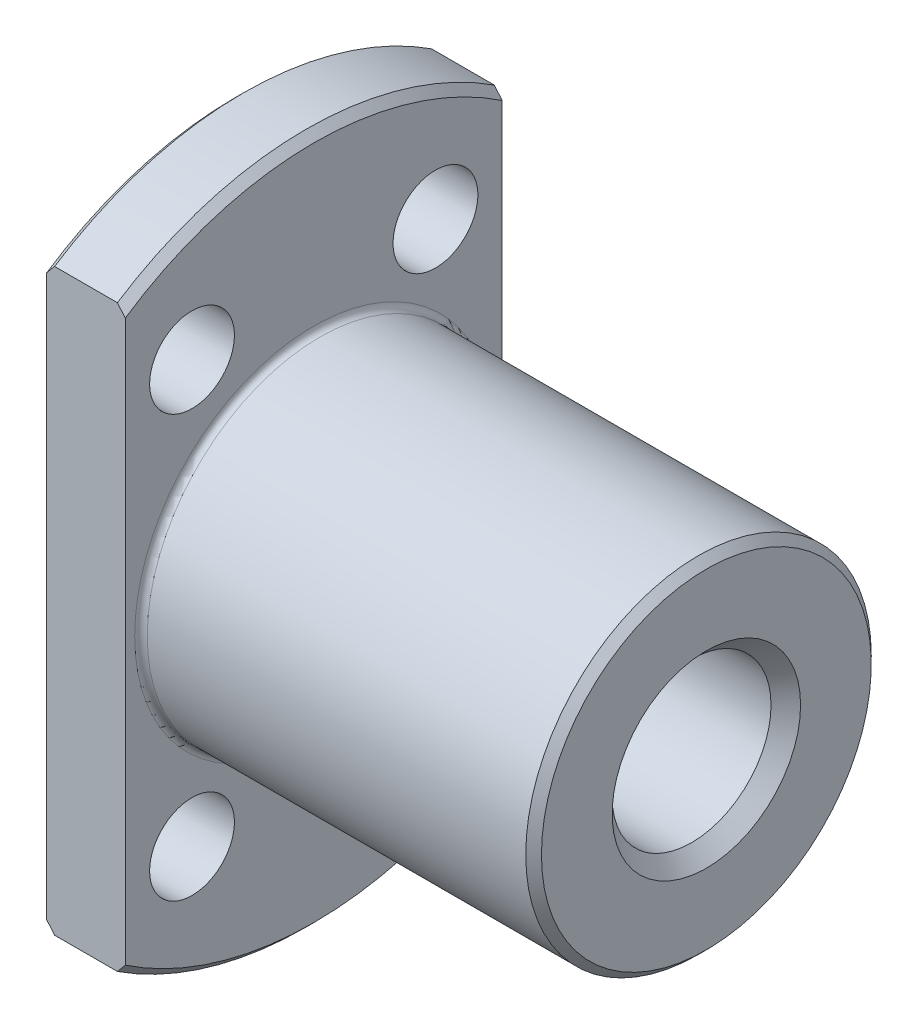
ISO-10303-21;
HEADER;
FILE_DESCRIPTION(('STEP AP214'),'2;1');
FILE_NAME('part.step','',(''),(''),'','','');
FILE_SCHEMA(('AUTOMOTIVE_DESIGN { 1 0 10303 214 1 1 1 1 }'));
ENDSEC;
DATA;
#1=APPLICATION_CONTEXT('core data for automotive mechanical design processes');
#2=APPLICATION_PROTOCOL_DEFINITION('international standard','automotive_design',2000,#1);
#3=PRODUCT_CONTEXT('',#1,'mechanical');
#4=PRODUCT('Part','Part','',(#3));
#5=PRODUCT_RELATED_PRODUCT_CATEGORY('part','',(#4));
#6=PRODUCT_DEFINITION_FORMATION('','',#4);
#7=PRODUCT_DEFINITION_CONTEXT('part definition',#1,'design');
#8=PRODUCT_DEFINITION('design','',#6,#7);
#9=PRODUCT_DEFINITION_SHAPE('','',#8);
#10=(LENGTH_UNIT() NAMED_UNIT(*) SI_UNIT(.MILLI.,.METRE.));
#11=(NAMED_UNIT(*) PLANE_ANGLE_UNIT() SI_UNIT($,.RADIAN.));
#12=(NAMED_UNIT(*) SI_UNIT($,.STERADIAN.) SOLID_ANGLE_UNIT());
#13=UNCERTAINTY_MEASURE_WITH_UNIT(LENGTH_MEASURE(1.E-05),#10,'distance_accuracy_value','');
#14=(GEOMETRIC_REPRESENTATION_CONTEXT(3) GLOBAL_UNCERTAINTY_ASSIGNED_CONTEXT((#13)) GLOBAL_UNIT_ASSIGNED_CONTEXT((#10,
#11,#12)) REPRESENTATION_CONTEXT('',''));
#15=CARTESIAN_POINT('',(0.,0.,0.));
#16=DIRECTION('',(0.,0.,1.));
#17=DIRECTION('',(1.,0.,0.));
#18=AXIS2_PLACEMENT_3D('',#15,#16,#17);
#19=CARTESIAN_POINT('',(0.499999999998697,0.,0.));
#20=DIRECTION('',(1.,0.,0.));
#21=DIRECTION('',(0.,0.,-1.));
#22=AXIS2_PLACEMENT_3D('',#19,#20,#21);
#23=CONICAL_SURFACE('',#22,22.0000000000013,0.7853981634);
#24=CARTESIAN_POINT('',(0.499999999998473,18.439088914587,-12.));
#25=CARTESIAN_POINT('',(0.416419384931429,18.3393741252756,-12.));
#26=CARTESIAN_POINT('',(0.332962411462513,18.2395562198613,-12.));
#27=CARTESIAN_POINT('',(0.166295744787639,18.03971417331,-12.));
#28=CARTESIAN_POINT('',(0.0830860515903839,17.9396900321657,-12.));
#29=CARTESIAN_POINT('',(0.,17.8395627749112,-12.));
#30=B_SPLINE_CURVE_WITH_KNOTS('',3,(#24,#25,#26,#27,#28,#29),.UNSPECIFIED.,.F.,.F.,(4,2,4),(0.,
0.39033079042897,0.780661594597441),.UNSPECIFIED.);
#31=CARTESIAN_POINT('',(0.49999999999924,18.4390889145863,-12.));
#32=VERTEX_POINT('',#31);
#33=CARTESIAN_POINT('',(0.,17.8395627749112,-12.));
#34=VERTEX_POINT('',#33);
#35=EDGE_CURVE('E101',#32,#34,#30,.T.);
#36=ORIENTED_EDGE('',*,*,#35,.T.);
#37=CARTESIAN_POINT('',(0.,0.,0.));
#38=DIRECTION('',(1.,0.,0.));
#39=DIRECTION('',(0.,0.,-1.));
#40=AXIS2_PLACEMENT_3D('',#37,#38,#39);
#41=CIRCLE('',#40,21.5);
#42=CARTESIAN_POINT('',(0.,17.8395627749112,12.));
#43=VERTEX_POINT('',#42);
#44=EDGE_CURVE('E99',#43,#34,#41,.F.);
#45=ORIENTED_EDGE('',*,*,#44,.F.);
#46=CARTESIAN_POINT('',(0.,17.8395627749112,12.));
#47=CARTESIAN_POINT('',(0.0830860515903839,17.9396900321657,12.));
#48=CARTESIAN_POINT('',(0.166295744787639,18.03971417331,12.));
#49=CARTESIAN_POINT('',(0.332962411462513,18.2395562198613,12.));
#50=CARTESIAN_POINT('',(0.416419384931428,18.3393741252756,12.));
#51=CARTESIAN_POINT('',(0.499999999998474,18.439088914587,12.));
#52=B_SPLINE_CURVE_WITH_KNOTS('',3,(#46,#47,#48,#49,#50,#51),.UNSPECIFIED.,.F.,.F.,(4,2,4),(0.,
0.390330804168474,0.780661594597444),.UNSPECIFIED.);
#53=CARTESIAN_POINT('',(0.49999999999924,18.4390889145863,12.));
#54=VERTEX_POINT('',#53);
#55=EDGE_CURVE('E21',#43,#54,#52,.T.);
#56=ORIENTED_EDGE('',*,*,#55,.T.);
#57=CARTESIAN_POINT('',(0.500000000000007,0.,0.));
#58=DIRECTION('',(1.,0.,0.));
#59=DIRECTION('',(0.,0.,-1.));
#60=AXIS2_PLACEMENT_3D('',#57,#58,#59);
#61=CIRCLE('',#60,22.);
#62=EDGE_CURVE('E96',#32,#54,#61,.T.);
#63=ORIENTED_EDGE('',*,*,#62,.F.);
#64=EDGE_LOOP('',(#36,#45,#56,#63));
#65=FACE_BOUND('',#64,.T.);
#66=ADVANCED_FACE('F17',(#65),#23,.T.);
#67=CARTESIAN_POINT('',(0.499999999998697,0.,0.));
#68=DIRECTION('',(1.,0.,0.));
#69=DIRECTION('',(0.,0.,-1.));
#70=AXIS2_PLACEMENT_3D('',#67,#68,#69);
#71=CONICAL_SURFACE('',#70,22.0000000000013,0.7853981634);
#72=CARTESIAN_POINT('',(0.499999999998472,-18.439088914587,12.));
#73=CARTESIAN_POINT('',(0.416419384931427,-18.3393741252756,12.));
#74=CARTESIAN_POINT('',(0.332962411462512,-18.2395562198613,12.));
#75=CARTESIAN_POINT('',(0.166295744787637,-18.03971417331,12.));
#76=CARTESIAN_POINT('',(0.083086051590382,-17.9396900321657,12.));
#77=CARTESIAN_POINT('',(0.,-17.8395627749112,12.));
#78=B_SPLINE_CURVE_WITH_KNOTS('',3,(#72,#73,#74,#75,#76,#77),.UNSPECIFIED.,.F.,.F.,(4,2,4),(0.,
0.39033079042897,0.780661594597445),.UNSPECIFIED.);
#79=CARTESIAN_POINT('',(0.49999999999924,-18.4390889145863,12.));
#80=VERTEX_POINT('',#79);
#81=CARTESIAN_POINT('',(0.,-17.8395627749112,12.));
#82=VERTEX_POINT('',#81);
#83=EDGE_CURVE('E132',#80,#82,#78,.T.);
#84=ORIENTED_EDGE('',*,*,#83,.T.);
#85=CARTESIAN_POINT('',(0.,0.,0.));
#86=DIRECTION('',(1.,0.,0.));
#87=DIRECTION('',(0.,0.,-1.));
#88=AXIS2_PLACEMENT_3D('',#85,#86,#87);
#89=CIRCLE('',#88,21.5);
#90=CARTESIAN_POINT('',(0.,-17.8395627749112,-12.));
#91=VERTEX_POINT('',#90);
#92=EDGE_CURVE('E217',#91,#82,#89,.F.);
#93=ORIENTED_EDGE('',*,*,#92,.F.);
#94=CARTESIAN_POINT('',(0.,-17.8395627749112,-12.));
#95=CARTESIAN_POINT('',(0.0830860515903842,-17.9396900321657,-12.));
#96=CARTESIAN_POINT('',(0.166295744787639,-18.03971417331,-12.));
#97=CARTESIAN_POINT('',(0.332962411462515,-18.2395562198613,-12.));
#98=CARTESIAN_POINT('',(0.416419384931431,-18.3393741252756,-12.));
#99=CARTESIAN_POINT('',(0.499999999998477,-18.439088914587,-12.));
#100=B_SPLINE_CURVE_WITH_KNOTS('',3,(#94,#95,#96,#97,#98,#99),.UNSPECIFIED.,.F.,.F.,(4,2,4),(0.,
0.390330804168474,0.780661594597449),.UNSPECIFIED.);
#101=CARTESIAN_POINT('',(0.499999999999242,-18.4390889145864,-12.));
#102=VERTEX_POINT('',#101);
#103=EDGE_CURVE('E226',#91,#102,#100,.T.);
#104=ORIENTED_EDGE('',*,*,#103,.T.);
#105=CARTESIAN_POINT('',(0.500000000000007,0.,0.));
#106=DIRECTION('',(1.,0.,0.));
#107=DIRECTION('',(0.,0.,-1.));
#108=AXIS2_PLACEMENT_3D('',#105,#106,#107);
#109=CIRCLE('',#108,22.);
#110=EDGE_CURVE('E109',#80,#102,#109,.T.);
#111=ORIENTED_EDGE('',*,*,#110,.F.);
#112=EDGE_LOOP('',(#84,#93,#104,#111));
#113=FACE_BOUND('',#112,.T.);
#114=ADVANCED_FACE('F231',(#113),#71,.T.);
#115=CARTESIAN_POINT('',(5.6843418860808E-11,0.,0.));
#116=DIRECTION('',(-1.,0.,0.));
#117=DIRECTION('',(0.,0.,1.));
#118=AXIS2_PLACEMENT_3D('',#115,#116,#117);
#119=CONICAL_SURFACE('',#118,5.99999999997181,0.785398163367245);
#120=CARTESIAN_POINT('',(5.6843418860808E-11,0.,0.));
#121=DIRECTION('',(-1.,0.,0.));
#122=DIRECTION('',(0.,0.,1.));
#123=AXIS2_PLACEMENT_3D('',#120,#121,#122);
#124=CIRCLE('',#123,5.99999999997181);
#125=CARTESIAN_POINT('',(5.6843418860808E-11,0.,5.99999999997181));
#126=VERTEX_POINT('',#125);
#127=EDGE_CURVE('E213',#126,#126,#124,.F.);
#128=ORIENTED_EDGE('',*,*,#127,.F.);
#129=EDGE_LOOP('',(#128));
#130=FACE_BOUND('',#129,.T.);
#131=CARTESIAN_POINT('',(0.940999999995196,0.,0.));
#132=DIRECTION('',(-1.,0.,0.));
#133=DIRECTION('',(0.,0.,1.));
#134=AXIS2_PLACEMENT_3D('',#131,#132,#133);
#135=CIRCLE('',#134,5.059);
#136=CARTESIAN_POINT('',(0.940999999995196,0.,5.059));
#137=VERTEX_POINT('',#136);
#138=EDGE_CURVE('E216',#137,#137,#135,.F.);
#139=ORIENTED_EDGE('',*,*,#138,.T.);
#140=EDGE_LOOP('',(#139));
#141=FACE_BOUND('',#140,.T.);
#142=ADVANCED_FACE('F235',(#130,#141),#119,.F.);
#143=CARTESIAN_POINT('',(5.,0.,0.));
#144=DIRECTION('',(1.,0.,0.));
#145=DIRECTION('',(0.,0.,-1.));
#146=AXIS2_PLACEMENT_3D('',#143,#144,#145);
#147=CYLINDRICAL_SURFACE('',#146,22.);
#148=DIRECTION('',(1.,0.,0.));
#149=VECTOR('',#148,1.);
#150=CARTESIAN_POINT('',(5.,-18.4390889145857,12.));
#151=LINE('',#150,#149);
#152=CARTESIAN_POINT('',(4.50000000000003,-18.4390889145857,12.));
#153=VERTEX_POINT('',#152);
#154=EDGE_CURVE('E126',#80,#153,#151,.T.);
#155=ORIENTED_EDGE('',*,*,#154,.F.);
#156=ORIENTED_EDGE('',*,*,#110,.T.);
#157=DIRECTION('',(-1.,0.,0.));
#158=VECTOR('',#157,1.);
#159=CARTESIAN_POINT('',(5.,-18.4390889145857,-12.));
#160=LINE('',#159,#158);
#161=CARTESIAN_POINT('',(4.50000000000005,-18.4390889145857,-12.));
#162=VERTEX_POINT('',#161);
#163=EDGE_CURVE('E133',#162,#102,#160,.T.);
#164=ORIENTED_EDGE('',*,*,#163,.F.);
#165=CARTESIAN_POINT('',(4.50000000000003,0.,0.));
#166=DIRECTION('',(-1.,0.,0.));
#167=DIRECTION('',(0.,0.,1.));
#168=AXIS2_PLACEMENT_3D('',#165,#166,#167);
#169=CIRCLE('',#168,22.);
#170=EDGE_CURVE('E123',#153,#162,#169,.F.);
#171=ORIENTED_EDGE('',*,*,#170,.F.);
#172=EDGE_LOOP('',(#155,#156,#164,#171));
#173=FACE_BOUND('',#172,.T.);
#174=ADVANCED_FACE('F240',(#173),#147,.T.);
#175=CARTESIAN_POINT('',(5.,0.,0.));
#176=DIRECTION('',(1.,0.,0.));
#177=DIRECTION('',(0.,0.,-1.));
#178=AXIS2_PLACEMENT_3D('',#175,#176,#177);
#179=CYLINDRICAL_SURFACE('',#178,22.);
#180=DIRECTION('',(-1.,0.,0.));
#181=VECTOR('',#180,1.);
#182=CARTESIAN_POINT('',(5.,18.4390889145857,-12.));
#183=LINE('',#182,#181);
#184=CARTESIAN_POINT('',(4.50000000000003,18.4390889145857,-12.));
#185=VERTEX_POINT('',#184);
#186=EDGE_CURVE('E108',#32,#185,#183,.F.);
#187=ORIENTED_EDGE('',*,*,#186,.F.);
#188=ORIENTED_EDGE('',*,*,#62,.T.);
#189=DIRECTION('',(1.,0.,0.));
#190=VECTOR('',#189,1.);
#191=CARTESIAN_POINT('',(5.,18.4390889145857,12.));
#192=LINE('',#191,#190);
#193=CARTESIAN_POINT('',(4.50000000000005,18.4390889145857,12.));
#194=VERTEX_POINT('',#193);
#195=EDGE_CURVE('E105',#194,#54,#192,.F.);
#196=ORIENTED_EDGE('',*,*,#195,.F.);
#197=CARTESIAN_POINT('',(4.50000000000003,0.,0.));
#198=DIRECTION('',(-1.,0.,0.));
#199=DIRECTION('',(0.,0.,1.));
#200=AXIS2_PLACEMENT_3D('',#197,#198,#199);
#201=CIRCLE('',#200,22.);
#202=EDGE_CURVE('E122',#185,#194,#201,.F.);
#203=ORIENTED_EDGE('',*,*,#202,.F.);
#204=EDGE_LOOP('',(#187,#188,#196,#203));
#205=FACE_BOUND('',#204,.T.);
#206=ADVANCED_FACE('F104',(#205),#179,.T.);
#207=CARTESIAN_POINT('',(0.,0.,0.));
#208=DIRECTION('',(-1.,0.,0.));
#209=DIRECTION('',(0.,0.,1.));
#210=AXIS2_PLACEMENT_3D('',#207,#208,#209);
#211=PLANE('',#210);
#212=CARTESIAN_POINT('',(0.,13.4233937586588,7.75));
#213=DIRECTION('',(-1.,0.,0.));
#214=DIRECTION('',(0.,0.,1.));
#215=AXIS2_PLACEMENT_3D('',#212,#213,#214);
#216=CIRCLE('',#215,2.7);
#217=CARTESIAN_POINT('',(0.,13.4233937586588,10.45));
#218=VERTEX_POINT('',#217);
#219=EDGE_CURVE('E167',#218,#218,#216,.F.);
#220=ORIENTED_EDGE('',*,*,#219,.T.);
#221=EDGE_LOOP('',(#220));
#222=FACE_BOUND('',#221,.T.);
#223=CARTESIAN_POINT('',(0.,13.4233937586588,-7.75));
#224=DIRECTION('',(-1.,0.,0.));
#225=DIRECTION('',(0.,0.,1.));
#226=AXIS2_PLACEMENT_3D('',#223,#224,#225);
#227=CIRCLE('',#226,2.7);
#228=CARTESIAN_POINT('',(0.,13.4233937586588,-5.05));
#229=VERTEX_POINT('',#228);
#230=EDGE_CURVE('E170',#229,#229,#227,.F.);
#231=ORIENTED_EDGE('',*,*,#230,.T.);
#232=EDGE_LOOP('',(#231));
#233=FACE_BOUND('',#232,.T.);
#234=CARTESIAN_POINT('',(0.,-13.4233937586588,-7.75));
#235=DIRECTION('',(-1.,0.,0.));
#236=DIRECTION('',(0.,0.,1.));
#237=AXIS2_PLACEMENT_3D('',#234,#235,#236);
#238=CIRCLE('',#237,2.7);
#239=CARTESIAN_POINT('',(0.,-13.4233937586588,-5.05));
#240=VERTEX_POINT('',#239);
#241=EDGE_CURVE('E173',#240,#240,#238,.F.);
#242=ORIENTED_EDGE('',*,*,#241,.T.);
#243=EDGE_LOOP('',(#242));
#244=FACE_BOUND('',#243,.T.);
#245=CARTESIAN_POINT('',(0.,-13.4233937586588,7.75));
#246=DIRECTION('',(-1.,0.,0.));
#247=DIRECTION('',(0.,0.,1.));
#248=AXIS2_PLACEMENT_3D('',#245,#246,#247);
#249=CIRCLE('',#248,2.7);
#250=CARTESIAN_POINT('',(0.,-13.4233937586588,10.45));
#251=VERTEX_POINT('',#250);
#252=EDGE_CURVE('E116',#251,#251,#249,.F.);
#253=ORIENTED_EDGE('',*,*,#252,.T.);
#254=EDGE_LOOP('',(#253));
#255=FACE_BOUND('',#254,.T.);
#256=ORIENTED_EDGE('',*,*,#127,.T.);
#257=EDGE_LOOP('',(#256));
#258=FACE_BOUND('',#257,.T.);
#259=DIRECTION('',(0.,1.,0.));
#260=VECTOR('',#259,1.);
#261=CARTESIAN_POINT('',(0.,18.4390889145857,-12.));
#262=LINE('',#261,#260);
#263=EDGE_CURVE('E136',#91,#34,#262,.T.);
#264=ORIENTED_EDGE('',*,*,#263,.F.);
#265=ORIENTED_EDGE('',*,*,#92,.T.);
#266=DIRECTION('',(0.,1.,0.));
#267=VECTOR('',#266,1.);
#268=CARTESIAN_POINT('',(0.,-18.4390889145857,12.));
#269=LINE('',#268,#267);
#270=EDGE_CURVE('E114',#43,#82,#269,.F.);
#271=ORIENTED_EDGE('',*,*,#270,.F.);
#272=ORIENTED_EDGE('',*,*,#44,.T.);
#273=EDGE_LOOP('',(#264,#265,#271,#272));
#274=FACE_BOUND('',#273,.T.);
#275=ADVANCED_FACE('F246',(#222,#233,#244,#255,#258,#274),#211,.T.);
#276=CARTESIAN_POINT('',(30.,0.,0.));
#277=DIRECTION('',(-1.,0.,0.));
#278=DIRECTION('',(0.,0.,1.));
#279=AXIS2_PLACEMENT_3D('',#276,#277,#278);
#280=CYLINDRICAL_SURFACE('',#279,5.059);
#281=ORIENTED_EDGE('',*,*,#138,.F.);
#282=EDGE_LOOP('',(#281));
#283=FACE_BOUND('',#282,.T.);
#284=CARTESIAN_POINT('',(29.0590000000179,0.,0.));
#285=DIRECTION('',(1.,0.,0.));
#286=DIRECTION('',(0.,0.,-1.));
#287=AXIS2_PLACEMENT_3D('',#284,#285,#286);
#288=CIRCLE('',#287,5.05899999996018);
#289=CARTESIAN_POINT('',(29.0590000000179,0.,-5.05899999996018));
#290=VERTEX_POINT('',#289);
#291=EDGE_CURVE('E166',#290,#290,#288,.T.);
#292=ORIENTED_EDGE('',*,*,#291,.T.);
#293=EDGE_LOOP('',(#292));
#294=FACE_BOUND('',#293,.T.);
#295=ADVANCED_FACE('F197',(#283,#294),#280,.F.);
#296=CARTESIAN_POINT('',(4.50000000000003,0.,0.));
#297=DIRECTION('',(-1.,0.,0.));
#298=DIRECTION('',(0.,0.,1.));
#299=AXIS2_PLACEMENT_3D('',#296,#297,#298);
#300=CONICAL_SURFACE('',#299,22.,0.785398163399998);
#301=CARTESIAN_POINT('',(4.50000000000004,18.4390889145857,-12.));
#302=CARTESIAN_POINT('',(4.58358061506707,18.3393741252743,-12.));
#303=CARTESIAN_POINT('',(4.66703758853597,18.2395562198601,-12.));
#304=CARTESIAN_POINT('',(4.83370425521082,18.0397141733088,-12.));
#305=CARTESIAN_POINT('',(4.91691394840807,17.9396900321645,-12.));
#306=CARTESIAN_POINT('',(4.99999999999847,17.83956277491,-12.));
#307=B_SPLINE_CURVE_WITH_KNOTS('',3,(#301,#302,#303,#304,#305,#306),.UNSPECIFIED.,.F.,.F.,(4,2,
4),(0.,0.390330790428918,0.780661594597336),.UNSPECIFIED.);
#308=CARTESIAN_POINT('',(4.99999999999859,17.8395627749099,-12.));
#309=VERTEX_POINT('',#308);
#310=EDGE_CURVE('E137',#185,#309,#307,.T.);
#311=ORIENTED_EDGE('',*,*,#310,.F.);
#312=ORIENTED_EDGE('',*,*,#202,.T.);
#313=CARTESIAN_POINT('',(4.99999999999847,17.83956277491,12.));
#314=CARTESIAN_POINT('',(4.91691394840807,17.9396900321645,12.));
#315=CARTESIAN_POINT('',(4.83370425521082,18.0397141733088,12.));
#316=CARTESIAN_POINT('',(4.66703758853597,18.2395562198601,12.));
#317=CARTESIAN_POINT('',(4.58358061506707,18.3393741252743,12.));
#318=CARTESIAN_POINT('',(4.50000000000004,18.4390889145857,12.));
#319=B_SPLINE_CURVE_WITH_KNOTS('',3,(#313,#314,#315,#316,#317,#318),.UNSPECIFIED.,.F.,.F.,(4,2,
4),(0.,0.390330804168418,0.780661594597337),.UNSPECIFIED.);
#320=CARTESIAN_POINT('',(4.99999999999859,17.8395627749099,12.));
#321=VERTEX_POINT('',#320);
#322=EDGE_CURVE('E113',#321,#194,#319,.T.);
#323=ORIENTED_EDGE('',*,*,#322,.F.);
#324=CARTESIAN_POINT('',(4.99999999999871,0.,0.));
#325=DIRECTION('',(-1.,0.,0.));
#326=DIRECTION('',(0.,0.,1.));
#327=AXIS2_PLACEMENT_3D('',#324,#325,#326);
#328=CIRCLE('',#327,21.4999999999987);
#329=EDGE_CURVE('E164',#321,#309,#328,.T.);
#330=ORIENTED_EDGE('',*,*,#329,.T.);
#331=EDGE_LOOP('',(#311,#312,#323,#330));
#332=FACE_BOUND('',#331,.T.);
#333=ADVANCED_FACE('F191',(#332),#300,.T.);
#334=CARTESIAN_POINT('',(5.,18.4390889145857,-12.));
#335=DIRECTION('',(0.,0.,-1.));
#336=DIRECTION('',(-1.,0.,0.));
#337=AXIS2_PLACEMENT_3D('',#334,#335,#336);
#338=PLANE('',#337);
#339=ORIENTED_EDGE('',*,*,#186,.T.);
#340=ORIENTED_EDGE('',*,*,#310,.T.);
#341=DIRECTION('',(0.,1.,0.));
#342=VECTOR('',#341,1.);
#343=CARTESIAN_POINT('',(5.,0.,-12.));
#344=LINE('',#343,#342);
#345=CARTESIAN_POINT('',(4.99999999999924,-17.8395627749091,-12.));
#346=VERTEX_POINT('',#345);
#347=EDGE_CURVE('E163',#309,#346,#344,.F.);
#348=ORIENTED_EDGE('',*,*,#347,.T.);
#349=CARTESIAN_POINT('',(4.50000000000003,-18.4390889145857,-12.));
#350=CARTESIAN_POINT('',(4.58358061506707,-18.3393741252743,-12.));
#351=CARTESIAN_POINT('',(4.66703758853597,-18.2395562198601,-12.));
#352=CARTESIAN_POINT('',(4.83370425521082,-18.0397141733088,-12.));
#353=CARTESIAN_POINT('',(4.91691394840807,-17.9396900321645,-12.));
#354=CARTESIAN_POINT('',(4.99999999999847,-17.83956277491,-12.));
#355=B_SPLINE_CURVE_WITH_KNOTS('',3,(#349,#350,#351,#352,#353,#354),.UNSPECIFIED.,.F.,.F.,(4,2,
4),(0.,0.390330790428921,0.780661594597343),.UNSPECIFIED.);
#356=EDGE_CURVE('E127',#162,#346,#355,.T.);
#357=ORIENTED_EDGE('',*,*,#356,.F.);
#358=ORIENTED_EDGE('',*,*,#163,.T.);
#359=ORIENTED_EDGE('',*,*,#103,.F.);
#360=ORIENTED_EDGE('',*,*,#263,.T.);
#361=ORIENTED_EDGE('',*,*,#35,.F.);
#362=EDGE_LOOP('',(#339,#340,#348,#357,#358,#359,#360,#361));
#363=FACE_BOUND('',#362,.T.);
#364=ADVANCED_FACE('F196',(#363),#338,.T.);
#365=CARTESIAN_POINT('',(4.50000000000003,0.,0.));
#366=DIRECTION('',(-1.,0.,0.));
#367=DIRECTION('',(0.,0.,1.));
#368=AXIS2_PLACEMENT_3D('',#365,#366,#367);
#369=CONICAL_SURFACE('',#368,22.,0.785398163399998);
#370=CARTESIAN_POINT('',(4.50000000000003,-18.4390889145857,12.));
#371=CARTESIAN_POINT('',(4.58358061506707,-18.3393741252743,12.));
#372=CARTESIAN_POINT('',(4.66703758853597,-18.2395562198601,12.));
#373=CARTESIAN_POINT('',(4.83370425521082,-18.0397141733088,12.));
#374=CARTESIAN_POINT('',(4.91691394840807,-17.9396900321645,12.));
#375=CARTESIAN_POINT('',(4.99999999999847,-17.83956277491,12.));
#376=B_SPLINE_CURVE_WITH_KNOTS('',3,(#370,#371,#372,#373,#374,#375),.UNSPECIFIED.,.F.,.F.,(4,2,
4),(0.,0.390330790428919,0.780661594597338),.UNSPECIFIED.);
#377=CARTESIAN_POINT('',(4.99999999999859,-17.8395627749099,12.));
#378=VERTEX_POINT('',#377);
#379=EDGE_CURVE('E118',#153,#378,#376,.T.);
#380=ORIENTED_EDGE('',*,*,#379,.F.);
#381=ORIENTED_EDGE('',*,*,#170,.T.);
#382=ORIENTED_EDGE('',*,*,#356,.T.);
#383=CARTESIAN_POINT('',(4.99999999999871,0.,0.));
#384=DIRECTION('',(-1.,0.,0.));
#385=DIRECTION('',(0.,0.,1.));
#386=AXIS2_PLACEMENT_3D('',#383,#384,#385);
#387=CIRCLE('',#386,21.4999999999987);
#388=EDGE_CURVE('E161',#346,#378,#387,.T.);
#389=ORIENTED_EDGE('',*,*,#388,.T.);
#390=EDGE_LOOP('',(#380,#381,#382,#389));
#391=FACE_BOUND('',#390,.T.);
#392=ADVANCED_FACE('F424',(#391),#369,.T.);
#393=CARTESIAN_POINT('',(5.,-18.4390889145857,12.));
#394=DIRECTION('',(0.,0.,1.));
#395=DIRECTION('',(1.,0.,0.));
#396=AXIS2_PLACEMENT_3D('',#393,#394,#395);
#397=PLANE('',#396);
#398=ORIENTED_EDGE('',*,*,#270,.T.);
#399=ORIENTED_EDGE('',*,*,#83,.F.);
#400=ORIENTED_EDGE('',*,*,#154,.T.);
#401=ORIENTED_EDGE('',*,*,#379,.T.);
#402=DIRECTION('',(0.,1.,0.));
#403=VECTOR('',#402,1.);
#404=CARTESIAN_POINT('',(5.,0.,12.));
#405=LINE('',#404,#403);
#406=EDGE_CURVE('E160',#378,#321,#405,.T.);
#407=ORIENTED_EDGE('',*,*,#406,.T.);
#408=ORIENTED_EDGE('',*,*,#322,.T.);
#409=ORIENTED_EDGE('',*,*,#195,.T.);
#410=ORIENTED_EDGE('',*,*,#55,.F.);
#411=EDGE_LOOP('',(#398,#399,#400,#401,#407,#408,#409,#410));
#412=FACE_BOUND('',#411,.T.);
#413=ADVANCED_FACE('F111',(#412),#397,.T.);
#414=CARTESIAN_POINT('',(5.,-13.4233937586588,7.75));
#415=DIRECTION('',(-1.,0.,0.));
#416=DIRECTION('',(0.,0.,1.));
#417=AXIS2_PLACEMENT_3D('',#414,#415,#416);
#418=CYLINDRICAL_SURFACE('',#417,2.7);
#419=ORIENTED_EDGE('',*,*,#252,.F.);
#420=EDGE_LOOP('',(#419));
#421=FACE_BOUND('',#420,.T.);
#422=CARTESIAN_POINT('',(5.,-13.4233937586588,7.75));
#423=DIRECTION('',(-1.,0.,0.));
#424=DIRECTION('',(0.,0.,1.));
#425=AXIS2_PLACEMENT_3D('',#422,#423,#424);
#426=CIRCLE('',#425,2.7);
#427=CARTESIAN_POINT('',(5.,-13.4233937586588,10.45));
#428=VERTEX_POINT('',#427);
#429=EDGE_CURVE('E157',#428,#428,#426,.F.);
#430=ORIENTED_EDGE('',*,*,#429,.T.);
#431=EDGE_LOOP('',(#430));
#432=FACE_BOUND('',#431,.T.);
#433=ADVANCED_FACE('F408',(#421,#432),#418,.F.);
#434=CARTESIAN_POINT('',(5.,-13.4233937586588,-7.75));
#435=DIRECTION('',(-1.,0.,0.));
#436=DIRECTION('',(0.,0.,1.));
#437=AXIS2_PLACEMENT_3D('',#434,#435,#436);
#438=CYLINDRICAL_SURFACE('',#437,2.7);
#439=ORIENTED_EDGE('',*,*,#241,.F.);
#440=EDGE_LOOP('',(#439));
#441=FACE_BOUND('',#440,.T.);
#442=CARTESIAN_POINT('',(5.,-13.4233937586588,-7.75));
#443=DIRECTION('',(-1.,0.,0.));
#444=DIRECTION('',(0.,0.,1.));
#445=AXIS2_PLACEMENT_3D('',#442,#443,#444);
#446=CIRCLE('',#445,2.7);
#447=CARTESIAN_POINT('',(5.,-13.4233937586588,-5.05));
#448=VERTEX_POINT('',#447);
#449=EDGE_CURVE('E154',#448,#448,#446,.F.);
#450=ORIENTED_EDGE('',*,*,#449,.T.);
#451=EDGE_LOOP('',(#450));
#452=FACE_BOUND('',#451,.T.);
#453=ADVANCED_FACE('F399',(#441,#452),#438,.F.);
#454=CARTESIAN_POINT('',(5.,13.4233937586588,-7.75));
#455=DIRECTION('',(-1.,0.,0.));
#456=DIRECTION('',(0.,0.,1.));
#457=AXIS2_PLACEMENT_3D('',#454,#455,#456);
#458=CYLINDRICAL_SURFACE('',#457,2.7);
#459=ORIENTED_EDGE('',*,*,#230,.F.);
#460=EDGE_LOOP('',(#459));
#461=FACE_BOUND('',#460,.T.);
#462=CARTESIAN_POINT('',(5.,13.4233937586588,-7.75));
#463=DIRECTION('',(-1.,0.,0.));
#464=DIRECTION('',(0.,0.,1.));
#465=AXIS2_PLACEMENT_3D('',#462,#463,#464);
#466=CIRCLE('',#465,2.7);
#467=CARTESIAN_POINT('',(5.,13.4233937586588,-5.05));
#468=VERTEX_POINT('',#467);
#469=EDGE_CURVE('E151',#468,#468,#466,.F.);
#470=ORIENTED_EDGE('',*,*,#469,.T.);
#471=EDGE_LOOP('',(#470));
#472=FACE_BOUND('',#471,.T.);
#473=ADVANCED_FACE('F340',(#461,#472),#458,.F.);
#474=CARTESIAN_POINT('',(5.,13.4233937586588,7.75));
#475=DIRECTION('',(-1.,0.,0.));
#476=DIRECTION('',(0.,0.,1.));
#477=AXIS2_PLACEMENT_3D('',#474,#475,#476);
#478=CYLINDRICAL_SURFACE('',#477,2.7);
#479=ORIENTED_EDGE('',*,*,#219,.F.);
#480=EDGE_LOOP('',(#479));
#481=FACE_BOUND('',#480,.T.);
#482=CARTESIAN_POINT('',(5.,13.4233937586588,7.75));
#483=DIRECTION('',(-1.,0.,0.));
#484=DIRECTION('',(0.,0.,1.));
#485=AXIS2_PLACEMENT_3D('',#482,#483,#484);
#486=CIRCLE('',#485,2.7);
#487=CARTESIAN_POINT('',(5.,13.4233937586588,10.45));
#488=VERTEX_POINT('',#487);
#489=EDGE_CURVE('E148',#488,#488,#486,.F.);
#490=ORIENTED_EDGE('',*,*,#489,.T.);
#491=EDGE_LOOP('',(#490));
#492=FACE_BOUND('',#491,.T.);
#493=ADVANCED_FACE('F335',(#481,#492),#478,.F.);
#494=CARTESIAN_POINT('',(29.9999999999727,0.,0.));
#495=DIRECTION('',(1.,0.,0.));
#496=DIRECTION('',(0.,0.,-1.));
#497=AXIS2_PLACEMENT_3D('',#494,#495,#496);
#498=CONICAL_SURFACE('',#497,5.99999999991496,0.785398163397448);
#499=CARTESIAN_POINT('',(30.0000000000296,0.,0.));
#500=DIRECTION('',(1.,0.,0.));
#501=DIRECTION('',(0.,0.,-1.));
#502=AXIS2_PLACEMENT_3D('',#499,#500,#501);
#503=CIRCLE('',#502,5.99999999997181);
#504=CARTESIAN_POINT('',(30.0000000000296,0.,-5.99999999997181));
#505=VERTEX_POINT('',#504);
#506=EDGE_CURVE('E145',#505,#505,#503,.F.);
#507=ORIENTED_EDGE('',*,*,#506,.F.);
#508=EDGE_LOOP('',(#507));
#509=FACE_BOUND('',#508,.T.);
#510=ORIENTED_EDGE('',*,*,#291,.F.);
#511=EDGE_LOOP('',(#510));
#512=FACE_BOUND('',#511,.T.);
#513=ADVANCED_FACE('F294',(#509,#512),#498,.F.);
#514=CARTESIAN_POINT('',(5.,0.,0.));
#515=DIRECTION('',(-1.,0.,0.));
#516=DIRECTION('',(0.,0.,1.));
#517=AXIS2_PLACEMENT_3D('',#514,#515,#516);
#518=PLANE('',#517);
#519=ORIENTED_EDGE('',*,*,#489,.F.);
#520=EDGE_LOOP('',(#519));
#521=FACE_BOUND('',#520,.T.);
#522=ORIENTED_EDGE('',*,*,#469,.F.);
#523=EDGE_LOOP('',(#522));
#524=FACE_BOUND('',#523,.T.);
#525=ORIENTED_EDGE('',*,*,#449,.F.);
#526=EDGE_LOOP('',(#525));
#527=FACE_BOUND('',#526,.T.);
#528=ORIENTED_EDGE('',*,*,#429,.F.);
#529=EDGE_LOOP('',(#528));
#530=FACE_BOUND('',#529,.T.);
#531=CARTESIAN_POINT('',(5.,0.,0.));
#532=DIRECTION('',(1.,0.,0.));
#533=DIRECTION('',(0.,0.,1.));
#534=AXIS2_PLACEMENT_3D('',#531,#532,#533);
#535=CIRCLE('',#534,11.4);
#536=CARTESIAN_POINT('',(5.,0.,-11.4));
#537=VERTEX_POINT('',#536);
#538=CARTESIAN_POINT('',(5.,0.,11.4));
#539=VERTEX_POINT('',#538);
#540=EDGE_CURVE('E40',#537,#539,#535,.F.);
#541=ORIENTED_EDGE('',*,*,#540,.T.);
#542=CARTESIAN_POINT('',(5.,0.,0.));
#543=DIRECTION('',(1.,0.,0.));
#544=DIRECTION('',(0.,0.,-1.));
#545=AXIS2_PLACEMENT_3D('',#542,#543,#544);
#546=CIRCLE('',#545,11.4);
#547=EDGE_CURVE('E144',#539,#537,#546,.F.);
#548=ORIENTED_EDGE('',*,*,#547,.T.);
#549=EDGE_LOOP('',(#541,#548));
#550=FACE_BOUND('',#549,.T.);
#551=ORIENTED_EDGE('',*,*,#388,.F.);
#552=ORIENTED_EDGE('',*,*,#347,.F.);
#553=ORIENTED_EDGE('',*,*,#329,.F.);
#554=ORIENTED_EDGE('',*,*,#406,.F.);
#555=EDGE_LOOP('',(#551,#552,#553,#554));
#556=FACE_BOUND('',#555,.T.);
#557=ADVANCED_FACE('F285',(#521,#524,#527,#530,#550,#556),#518,.F.);
#558=CARTESIAN_POINT('',(30.,0.,0.));
#559=DIRECTION('',(1.,0.,0.));
#560=DIRECTION('',(0.,0.,-1.));
#561=AXIS2_PLACEMENT_3D('',#558,#559,#560);
#562=PLANE('',#561);
#563=ORIENTED_EDGE('',*,*,#506,.T.);
#564=EDGE_LOOP('',(#563));
#565=FACE_BOUND('',#564,.T.);
#566=CARTESIAN_POINT('',(30.,0.,0.));
#567=DIRECTION('',(-1.,0.,0.));
#568=DIRECTION('',(0.,0.,1.));
#569=AXIS2_PLACEMENT_3D('',#566,#567,#568);
#570=CIRCLE('',#569,10.5);
#571=CARTESIAN_POINT('',(30.,0.,10.5));
#572=VERTEX_POINT('',#571);
#573=EDGE_CURVE('E141',#572,#572,#570,.T.);
#574=ORIENTED_EDGE('',*,*,#573,.F.);
#575=EDGE_LOOP('',(#574));
#576=FACE_BOUND('',#575,.T.);
#577=ADVANCED_FACE('F272',(#565,#576),#562,.T.);
#578=CARTESIAN_POINT('',(5.4,0.,0.));
#579=DIRECTION('',(-1.,0.,0.));
#580=DIRECTION('',(0.,0.,1.));
#581=AXIS2_PLACEMENT_3D('',#578,#579,#580);
#582=TOROIDAL_SURFACE('',#581,11.4,0.4);
#583=CARTESIAN_POINT('',(5.4,0.,0.));
#584=DIRECTION('',(-1.,0.,0.));
#585=DIRECTION('',(0.,0.,1.));
#586=AXIS2_PLACEMENT_3D('',#583,#584,#585);
#587=CIRCLE('',#586,11.);
#588=CARTESIAN_POINT('',(5.4,0.,11.));
#589=VERTEX_POINT('',#588);
#590=EDGE_CURVE('E32',#589,#589,#587,.F.);
#591=ORIENTED_EDGE('',*,*,#590,.F.);
#592=EDGE_LOOP('',(#591));
#593=FACE_BOUND('',#592,.T.);
#594=ORIENTED_EDGE('',*,*,#540,.F.);
#595=ORIENTED_EDGE('',*,*,#547,.F.);
#596=EDGE_LOOP('',(#594,#595));
#597=FACE_BOUND('',#596,.T.);
#598=ADVANCED_FACE('F263',(#593,#597),#582,.F.);
#599=CARTESIAN_POINT('',(29.5000000000013,0.,0.));
#600=DIRECTION('',(-1.,0.,0.));
#601=DIRECTION('',(0.,0.,1.));
#602=AXIS2_PLACEMENT_3D('',#599,#600,#601);
#603=CONICAL_SURFACE('',#602,11.0000000000013,0.7853981634);
#604=ORIENTED_EDGE('',*,*,#573,.T.);
#605=EDGE_LOOP('',(#604));
#606=FACE_BOUND('',#605,.T.);
#607=CARTESIAN_POINT('',(29.5,0.,0.));
#608=DIRECTION('',(-1.,0.,0.));
#609=DIRECTION('',(0.,0.,1.));
#610=AXIS2_PLACEMENT_3D('',#607,#608,#609);
#611=CIRCLE('',#610,11.);
#612=CARTESIAN_POINT('',(29.5,0.,11.));
#613=VERTEX_POINT('',#612);
#614=EDGE_CURVE('E11',#613,#613,#611,.T.);
#615=ORIENTED_EDGE('',*,*,#614,.F.);
#616=EDGE_LOOP('',(#615));
#617=FACE_BOUND('',#616,.T.);
#618=ADVANCED_FACE('F257',(#606,#617),#603,.T.);
#619=CARTESIAN_POINT('',(5.,0.,0.));
#620=DIRECTION('',(-1.,0.,0.));
#621=DIRECTION('',(0.,0.,1.));
#622=AXIS2_PLACEMENT_3D('',#619,#620,#621);
#623=CYLINDRICAL_SURFACE('',#622,11.);
#624=ORIENTED_EDGE('',*,*,#614,.T.);
#625=EDGE_LOOP('',(#624));
#626=FACE_BOUND('',#625,.T.);
#627=ORIENTED_EDGE('',*,*,#590,.T.);
#628=EDGE_LOOP('',(#627));
#629=FACE_BOUND('',#628,.T.);
#630=ADVANCED_FACE('F255',(#626,#629),#623,.T.);
#631=CLOSED_SHELL('',(#66,#114,#142,#174,#206,#275,#295,#333,#364,#392,#413,#433,#453,#473,#493,
#513,#557,#577,#598,#618,#630));
#632=MANIFOLD_SOLID_BREP('B1',#631);
#633=ADVANCED_BREP_SHAPE_REPRESENTATION('',(#18,#632),#14);
#634=SHAPE_DEFINITION_REPRESENTATION(#9,#633);
ENDSEC;
END-ISO-10303-21;
